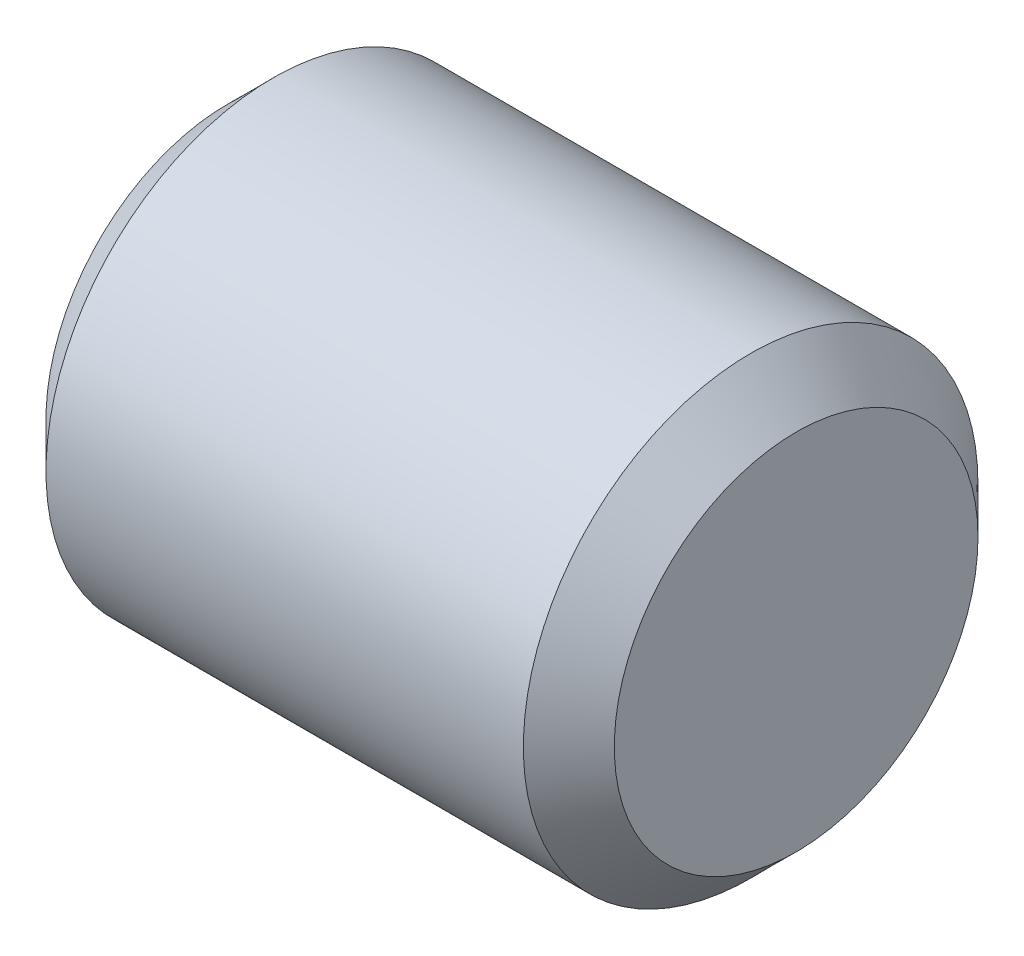
ISO-10303-21;
HEADER;
FILE_DESCRIPTION(('STEP AP214'),'2;1');
FILE_NAME('part.step','',(''),(''),'','','');
FILE_SCHEMA(('AUTOMOTIVE_DESIGN { 1 0 10303 214 1 1 1 1 }'));
ENDSEC;
DATA;
#1=APPLICATION_CONTEXT('core data for automotive mechanical design processes');
#2=APPLICATION_PROTOCOL_DEFINITION('international standard','automotive_design',2000,#1);
#3=PRODUCT_CONTEXT('',#1,'mechanical');
#4=PRODUCT('Part','Part','',(#3));
#5=PRODUCT_RELATED_PRODUCT_CATEGORY('part','',(#4));
#6=PRODUCT_DEFINITION_FORMATION('','',#4);
#7=PRODUCT_DEFINITION_CONTEXT('part definition',#1,'design');
#8=PRODUCT_DEFINITION('design','',#6,#7);
#9=PRODUCT_DEFINITION_SHAPE('','',#8);
#10=(LENGTH_UNIT() NAMED_UNIT(*) SI_UNIT(.MILLI.,.METRE.));
#11=(NAMED_UNIT(*) PLANE_ANGLE_UNIT() SI_UNIT($,.RADIAN.));
#12=(NAMED_UNIT(*) SI_UNIT($,.STERADIAN.) SOLID_ANGLE_UNIT());
#13=UNCERTAINTY_MEASURE_WITH_UNIT(LENGTH_MEASURE(1.E-05),#10,'distance_accuracy_value','');
#14=(GEOMETRIC_REPRESENTATION_CONTEXT(3) GLOBAL_UNCERTAINTY_ASSIGNED_CONTEXT((#13)) GLOBAL_UNIT_ASSIGNED_CONTEXT((#10,
#11,#12)) REPRESENTATION_CONTEXT('',''));
#15=CARTESIAN_POINT('',(0.,0.,0.));
#16=DIRECTION('',(0.,0.,1.));
#17=DIRECTION('',(1.,0.,0.));
#18=AXIS2_PLACEMENT_3D('',#15,#16,#17);
#19=CARTESIAN_POINT('',(-3.96875,0.,0.));
#20=DIRECTION('',(1.,0.,0.));
#21=DIRECTION('',(0.,0.,-1.));
#22=AXIS2_PLACEMENT_3D('',#19,#20,#21);
#23=CYLINDRICAL_SURFACE('',#22,3.175);
#24=CARTESIAN_POINT('',(3.33375,0.,0.));
#25=DIRECTION('',(1.,0.,0.));
#26=DIRECTION('',(0.,0.,-1.));
#27=AXIS2_PLACEMENT_3D('',#24,#25,#26);
#28=CIRCLE('',#27,3.175);
#29=CARTESIAN_POINT('',(3.33375,0.,-3.175));
#30=VERTEX_POINT('',#29);
#31=EDGE_CURVE('E37',#30,#30,#28,.F.);
#32=ORIENTED_EDGE('',*,*,#31,.T.);
#33=EDGE_LOOP('',(#32));
#34=FACE_BOUND('',#33,.T.);
#35=CARTESIAN_POINT('',(-3.33375,0.,0.));
#36=DIRECTION('',(1.,0.,0.));
#37=DIRECTION('',(0.,0.,-1.));
#38=AXIS2_PLACEMENT_3D('',#35,#36,#37);
#39=CIRCLE('',#38,3.175);
#40=CARTESIAN_POINT('',(-3.33375,0.,-3.175));
#41=VERTEX_POINT('',#40);
#42=EDGE_CURVE('E41',#41,#41,#39,.T.);
#43=ORIENTED_EDGE('',*,*,#42,.T.);
#44=EDGE_LOOP('',(#43));
#45=FACE_BOUND('',#44,.T.);
#46=ADVANCED_FACE('F30',(#34,#45),#23,.T.);
#47=CARTESIAN_POINT('',(-3.96875,0.,0.));
#48=DIRECTION('',(1.,0.,0.));
#49=DIRECTION('',(0.,0.,-1.));
#50=AXIS2_PLACEMENT_3D('',#47,#48,#49);
#51=PLANE('',#50);
#52=CARTESIAN_POINT('',(-3.96875,0.,0.));
#53=DIRECTION('',(1.,0.,0.));
#54=DIRECTION('',(0.,0.,-1.));
#55=AXIS2_PLACEMENT_3D('',#52,#53,#54);
#56=CIRCLE('',#55,2.54);
#57=CARTESIAN_POINT('',(-3.96875,0.,-2.54));
#58=VERTEX_POINT('',#57);
#59=EDGE_CURVE('E10',#58,#58,#56,.F.);
#60=ORIENTED_EDGE('',*,*,#59,.T.);
#61=EDGE_LOOP('',(#60));
#62=FACE_BOUND('',#61,.T.);
#63=ADVANCED_FACE('F61',(#62),#51,.F.);
#64=CARTESIAN_POINT('',(3.96875,0.,0.));
#65=DIRECTION('',(1.,0.,0.));
#66=DIRECTION('',(0.,0.,-1.));
#67=AXIS2_PLACEMENT_3D('',#64,#65,#66);
#68=PLANE('',#67);
#69=CARTESIAN_POINT('',(3.96875,0.,0.));
#70=DIRECTION('',(1.,0.,0.));
#71=DIRECTION('',(0.,0.,-1.));
#72=AXIS2_PLACEMENT_3D('',#69,#70,#71);
#73=CIRCLE('',#72,2.54);
#74=CARTESIAN_POINT('',(3.96875,0.,-2.54));
#75=VERTEX_POINT('',#74);
#76=EDGE_CURVE('E45',#75,#75,#73,.T.);
#77=ORIENTED_EDGE('',*,*,#76,.T.);
#78=EDGE_LOOP('',(#77));
#79=FACE_BOUND('',#78,.T.);
#80=ADVANCED_FACE('F51',(#79),#68,.T.);
#81=CARTESIAN_POINT('',(3.96875,0.,0.));
#82=DIRECTION('',(-1.,0.,0.));
#83=DIRECTION('',(0.,0.,1.));
#84=AXIS2_PLACEMENT_3D('',#81,#82,#83);
#85=CONICAL_SURFACE('',#84,2.54,0.785398163397446);
#86=ORIENTED_EDGE('',*,*,#31,.F.);
#87=EDGE_LOOP('',(#86));
#88=FACE_BOUND('',#87,.T.);
#89=ORIENTED_EDGE('',*,*,#76,.F.);
#90=EDGE_LOOP('',(#89));
#91=FACE_BOUND('',#90,.T.);
#92=ADVANCED_FACE('F53',(#88,#91),#85,.T.);
#93=CARTESIAN_POINT('',(-3.33375,0.,0.));
#94=DIRECTION('',(1.,0.,0.));
#95=DIRECTION('',(0.,0.,-1.));
#96=AXIS2_PLACEMENT_3D('',#93,#94,#95);
#97=CONICAL_SURFACE('',#96,3.175,0.785398163397451);
#98=ORIENTED_EDGE('',*,*,#59,.F.);
#99=EDGE_LOOP('',(#98));
#100=FACE_BOUND('',#99,.T.);
#101=ORIENTED_EDGE('',*,*,#42,.F.);
#102=EDGE_LOOP('',(#101));
#103=FACE_BOUND('',#102,.T.);
#104=ADVANCED_FACE('F32',(#100,#103),#97,.T.);
#105=CLOSED_SHELL('',(#46,#63,#80,#92,#104));
#106=MANIFOLD_SOLID_BREP('B2',#105);
#107=ADVANCED_BREP_SHAPE_REPRESENTATION('',(#18,#106),#14);
#108=SHAPE_DEFINITION_REPRESENTATION(#9,#107);
ENDSEC;
END-ISO-10303-21;
